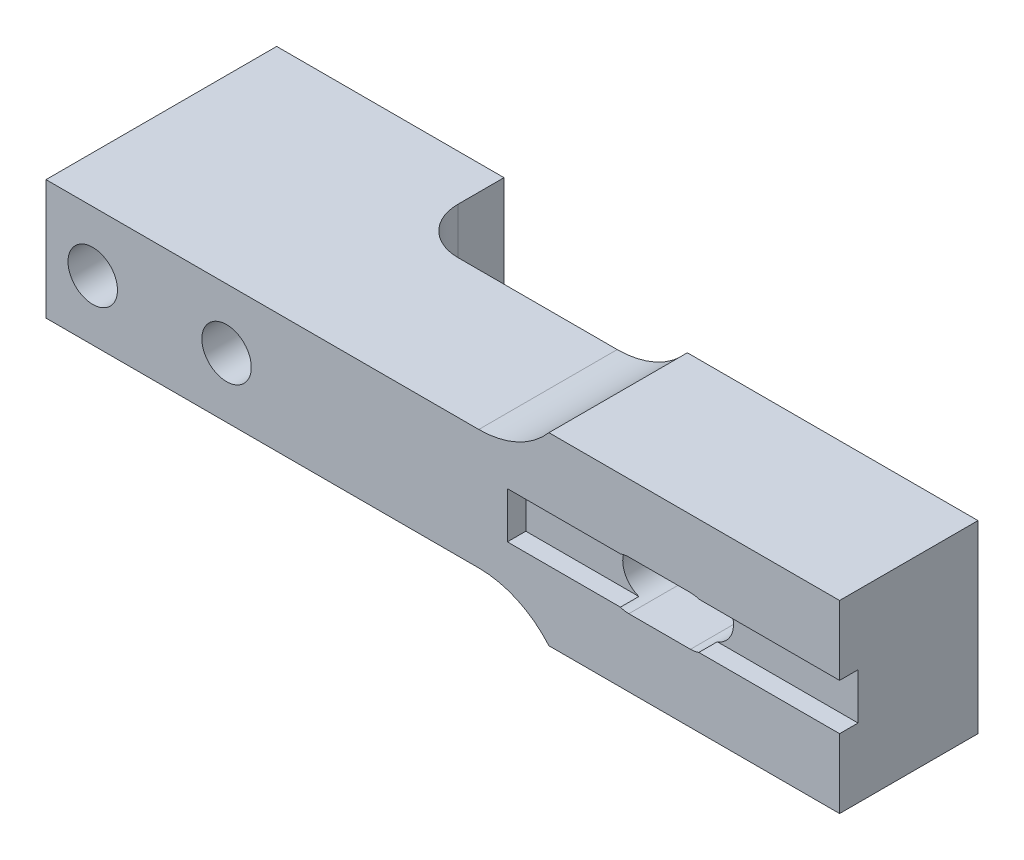
ISO-10303-21;
HEADER;
FILE_DESCRIPTION(('STEP AP214'),'2;1');
FILE_NAME('part.step','',(''),(''),'','','');
FILE_SCHEMA(('AUTOMOTIVE_DESIGN { 1 0 10303 214 1 1 1 1 }'));
ENDSEC;
DATA;
#1=APPLICATION_CONTEXT('core data for automotive mechanical design processes');
#2=APPLICATION_PROTOCOL_DEFINITION('international standard','automotive_design',2000,#1);
#3=PRODUCT_CONTEXT('',#1,'mechanical');
#4=PRODUCT('Part','Part','',(#3));
#5=PRODUCT_RELATED_PRODUCT_CATEGORY('part','',(#4));
#6=PRODUCT_DEFINITION_FORMATION('','',#4);
#7=PRODUCT_DEFINITION_CONTEXT('part definition',#1,'design');
#8=PRODUCT_DEFINITION('design','',#6,#7);
#9=PRODUCT_DEFINITION_SHAPE('','',#8);
#10=(LENGTH_UNIT() NAMED_UNIT(*) SI_UNIT(.MILLI.,.METRE.));
#11=(NAMED_UNIT(*) PLANE_ANGLE_UNIT() SI_UNIT($,.RADIAN.));
#12=(NAMED_UNIT(*) SI_UNIT($,.STERADIAN.) SOLID_ANGLE_UNIT());
#13=UNCERTAINTY_MEASURE_WITH_UNIT(LENGTH_MEASURE(1.E-05),#10,'distance_accuracy_value','');
#14=(GEOMETRIC_REPRESENTATION_CONTEXT(3) GLOBAL_UNCERTAINTY_ASSIGNED_CONTEXT((#13)) GLOBAL_UNIT_ASSIGNED_CONTEXT((#10,
#11,#12)) REPRESENTATION_CONTEXT('',''));
#15=CARTESIAN_POINT('',(0.,0.,0.));
#16=DIRECTION('',(0.,0.,1.));
#17=DIRECTION('',(1.,0.,0.));
#18=AXIS2_PLACEMENT_3D('',#15,#16,#17);
#19=CARTESIAN_POINT('',(0.,13.,10.));
#20=DIRECTION('',(0.,-1.,0.));
#21=DIRECTION('',(1.,0.,0.));
#22=AXIS2_PLACEMENT_3D('',#19,#20,#21);
#23=PLANE('',#22);
#24=DIRECTION('',(-1.,0.,0.));
#25=VECTOR('',#24,1.);
#26=CARTESIAN_POINT('',(0.,13.,25.));
#27=LINE('',#26,#25);
#28=CARTESIAN_POINT('',(46.9006579232147,13.,25.));
#29=VERTEX_POINT('',#28);
#30=CARTESIAN_POINT('',(0.,13.,25.));
#31=VERTEX_POINT('',#30);
#32=EDGE_CURVE('E357',#29,#31,#27,.T.);
#33=ORIENTED_EDGE('',*,*,#32,.F.);
#34=DIRECTION('',(0.,0.,-1.));
#35=VECTOR('',#34,1.);
#36=CARTESIAN_POINT('',(46.9006579232147,13.,10.));
#37=LINE('',#36,#35);
#38=CARTESIAN_POINT('',(46.9006579232147,13.,10.));
#39=VERTEX_POINT('',#38);
#40=EDGE_CURVE('E417',#29,#39,#37,.T.);
#41=ORIENTED_EDGE('',*,*,#40,.T.);
#42=DIRECTION('',(-1.,0.,0.));
#43=VECTOR('',#42,1.);
#44=CARTESIAN_POINT('',(0.,13.,10.));
#45=LINE('',#44,#43);
#46=CARTESIAN_POINT('',(29.634,13.,10.));
#47=VERTEX_POINT('',#46);
#48=EDGE_CURVE('E353',#39,#47,#45,.T.);
#49=ORIENTED_EDGE('',*,*,#48,.T.);
#50=CARTESIAN_POINT('',(29.634,13.,5.));
#51=DIRECTION('',(0.,-1.,0.));
#52=DIRECTION('',(1.,0.,0.));
#53=AXIS2_PLACEMENT_3D('',#50,#51,#52);
#54=CIRCLE('',#53,5.);
#55=CARTESIAN_POINT('',(24.634,13.,5.));
#56=VERTEX_POINT('',#55);
#57=EDGE_CURVE('E48',#47,#56,#54,.T.);
#58=ORIENTED_EDGE('',*,*,#57,.T.);
#59=DIRECTION('',(0.,0.,-1.));
#60=VECTOR('',#59,1.);
#61=CARTESIAN_POINT('',(24.634,13.,10.));
#62=LINE('',#61,#60);
#63=CARTESIAN_POINT('',(24.634,13.,0.));
#64=VERTEX_POINT('',#63);
#65=EDGE_CURVE('E383',#56,#64,#62,.T.);
#66=ORIENTED_EDGE('',*,*,#65,.T.);
#67=DIRECTION('',(-1.,0.,0.));
#68=VECTOR('',#67,1.);
#69=CARTESIAN_POINT('',(0.,13.,0.));
#70=LINE('',#69,#68);
#71=CARTESIAN_POINT('',(0.,13.,0.));
#72=VERTEX_POINT('',#71);
#73=EDGE_CURVE('E376',#64,#72,#70,.T.);
#74=ORIENTED_EDGE('',*,*,#73,.T.);
#75=DIRECTION('',(0.,0.,-1.));
#76=VECTOR('',#75,1.);
#77=CARTESIAN_POINT('',(0.,13.,10.));
#78=LINE('',#77,#76);
#79=EDGE_CURVE('E379',#31,#72,#78,.T.);
#80=ORIENTED_EDGE('',*,*,#79,.F.);
#81=EDGE_LOOP('',(#33,#41,#49,#58,#66,#74,#80));
#82=FACE_BOUND('',#81,.T.);
#83=ADVANCED_FACE('F39',(#82),#23,.F.);
#84=CARTESIAN_POINT('',(0.,13.,10.));
#85=DIRECTION('',(1.,0.,0.));
#86=DIRECTION('',(0.,0.,-1.));
#87=AXIS2_PLACEMENT_3D('',#84,#85,#86);
#88=PLANE('',#87);
#89=DIRECTION('',(0.,-1.,0.));
#90=VECTOR('',#89,1.);
#91=CARTESIAN_POINT('',(0.,13.,0.));
#92=LINE('',#91,#90);
#93=CARTESIAN_POINT('',(0.,0.,0.));
#94=VERTEX_POINT('',#93);
#95=EDGE_CURVE('E360',#72,#94,#92,.T.);
#96=ORIENTED_EDGE('',*,*,#95,.T.);
#97=DIRECTION('',(0.,0.,-1.));
#98=VECTOR('',#97,1.);
#99=CARTESIAN_POINT('',(0.,0.,10.));
#100=LINE('',#99,#98);
#101=CARTESIAN_POINT('',(0.,0.,25.));
#102=VERTEX_POINT('',#101);
#103=EDGE_CURVE('E389',#102,#94,#100,.T.);
#104=ORIENTED_EDGE('',*,*,#103,.F.);
#105=DIRECTION('',(0.,-1.,0.));
#106=VECTOR('',#105,1.);
#107=CARTESIAN_POINT('',(0.,0.,25.));
#108=LINE('',#107,#106);
#109=EDGE_CURVE('E348',#31,#102,#108,.T.);
#110=ORIENTED_EDGE('',*,*,#109,.F.);
#111=ORIENTED_EDGE('',*,*,#79,.T.);
#112=EDGE_LOOP('',(#96,#104,#110,#111));
#113=FACE_BOUND('',#112,.T.);
#114=ADVANCED_FACE('F481',(#113),#88,.F.);
#115=CARTESIAN_POINT('',(0.,0.,10.));
#116=DIRECTION('',(0.,1.,0.));
#117=DIRECTION('',(0.,0.,1.));
#118=AXIS2_PLACEMENT_3D('',#115,#116,#117);
#119=PLANE('',#118);
#120=DIRECTION('',(0.,0.,-1.));
#121=VECTOR('',#120,1.);
#122=CARTESIAN_POINT('',(24.634,0.,10.));
#123=LINE('',#122,#121);
#124=CARTESIAN_POINT('',(24.634,0.,5.));
#125=VERTEX_POINT('',#124);
#126=CARTESIAN_POINT('',(24.634,0.,0.));
#127=VERTEX_POINT('',#126);
#128=EDGE_CURVE('E386',#125,#127,#123,.T.);
#129=ORIENTED_EDGE('',*,*,#128,.F.);
#130=CARTESIAN_POINT('',(29.634,0.,5.));
#131=DIRECTION('',(0.,1.,0.));
#132=DIRECTION('',(0.,0.,1.));
#133=AXIS2_PLACEMENT_3D('',#130,#131,#132);
#134=CIRCLE('',#133,5.);
#135=CARTESIAN_POINT('',(29.634,0.,10.));
#136=VERTEX_POINT('',#135);
#137=EDGE_CURVE('E11',#125,#136,#134,.T.);
#138=ORIENTED_EDGE('',*,*,#137,.T.);
#139=DIRECTION('',(1.,0.,0.));
#140=VECTOR('',#139,1.);
#141=CARTESIAN_POINT('',(0.,0.,10.));
#142=LINE('',#141,#140);
#143=CARTESIAN_POINT('',(46.9006579232147,0.,10.));
#144=VERTEX_POINT('',#143);
#145=EDGE_CURVE('E347',#136,#144,#142,.T.);
#146=ORIENTED_EDGE('',*,*,#145,.T.);
#147=DIRECTION('',(0.,0.,1.));
#148=VECTOR('',#147,1.);
#149=CARTESIAN_POINT('',(46.9006579232147,0.,10.));
#150=LINE('',#149,#148);
#151=CARTESIAN_POINT('',(46.9006579232147,0.,25.));
#152=VERTEX_POINT('',#151);
#153=EDGE_CURVE('E420',#144,#152,#150,.T.);
#154=ORIENTED_EDGE('',*,*,#153,.T.);
#155=DIRECTION('',(1.,0.,0.));
#156=VECTOR('',#155,1.);
#157=CARTESIAN_POINT('',(0.,0.,25.));
#158=LINE('',#157,#156);
#159=EDGE_CURVE('E352',#102,#152,#158,.T.);
#160=ORIENTED_EDGE('',*,*,#159,.F.);
#161=ORIENTED_EDGE('',*,*,#103,.T.);
#162=DIRECTION('',(1.,0.,0.));
#163=VECTOR('',#162,1.);
#164=CARTESIAN_POINT('',(0.,0.,0.));
#165=LINE('',#164,#163);
#166=EDGE_CURVE('E368',#94,#127,#165,.T.);
#167=ORIENTED_EDGE('',*,*,#166,.T.);
#168=EDGE_LOOP('',(#129,#138,#146,#154,#160,#161,#167));
#169=FACE_BOUND('',#168,.T.);
#170=ADVANCED_FACE('F484',(#169),#119,.F.);
#171=CARTESIAN_POINT('',(24.634,13.,10.));
#172=DIRECTION('',(-1.,0.,0.));
#173=DIRECTION('',(0.,0.,1.));
#174=AXIS2_PLACEMENT_3D('',#171,#172,#173);
#175=PLANE('',#174);
#176=ORIENTED_EDGE('',*,*,#65,.F.);
#177=DIRECTION('',(0.,1.,0.));
#178=VECTOR('',#177,1.);
#179=CARTESIAN_POINT('',(24.634,13.,5.));
#180=LINE('',#179,#178);
#181=EDGE_CURVE('E55',#56,#125,#180,.F.);
#182=ORIENTED_EDGE('',*,*,#181,.T.);
#183=ORIENTED_EDGE('',*,*,#128,.T.);
#184=DIRECTION('',(0.,1.,0.));
#185=VECTOR('',#184,1.);
#186=CARTESIAN_POINT('',(24.634,13.,0.));
#187=LINE('',#186,#185);
#188=EDGE_CURVE('E372',#127,#64,#187,.T.);
#189=ORIENTED_EDGE('',*,*,#188,.T.);
#190=EDGE_LOOP('',(#176,#182,#183,#189));
#191=FACE_BOUND('',#190,.T.);
#192=ADVANCED_FACE('F506',(#191),#175,.F.);
#193=CARTESIAN_POINT('',(0.,0.,0.));
#194=DIRECTION('',(0.,0.,1.));
#195=DIRECTION('',(1.,0.,0.));
#196=AXIS2_PLACEMENT_3D('',#193,#194,#195);
#197=PLANE('',#196);
#198=CARTESIAN_POINT('',(5.067,6.5,0.));
#199=DIRECTION('',(0.,0.,-1.));
#200=DIRECTION('',(-1.,0.,0.));
#201=AXIS2_PLACEMENT_3D('',#198,#199,#200);
#202=CIRCLE('',#201,2.68);
#203=CARTESIAN_POINT('',(2.387,6.5,0.));
#204=VERTEX_POINT('',#203);
#205=EDGE_CURVE('E251',#204,#204,#202,.T.);
#206=ORIENTED_EDGE('',*,*,#205,.F.);
#207=EDGE_LOOP('',(#206));
#208=FACE_BOUND('',#207,.T.);
#209=CARTESIAN_POINT('',(19.567,6.5,0.));
#210=DIRECTION('',(0.,0.,-1.));
#211=DIRECTION('',(-1.,0.,0.));
#212=AXIS2_PLACEMENT_3D('',#209,#210,#211);
#213=CIRCLE('',#212,2.68);
#214=CARTESIAN_POINT('',(16.887,6.5,0.));
#215=VERTEX_POINT('',#214);
#216=EDGE_CURVE('E245',#215,#215,#213,.T.);
#217=ORIENTED_EDGE('',*,*,#216,.F.);
#218=EDGE_LOOP('',(#217));
#219=FACE_BOUND('',#218,.T.);
#220=ORIENTED_EDGE('',*,*,#95,.F.);
#221=ORIENTED_EDGE('',*,*,#73,.F.);
#222=ORIENTED_EDGE('',*,*,#188,.F.);
#223=ORIENTED_EDGE('',*,*,#166,.F.);
#224=EDGE_LOOP('',(#220,#221,#222,#223));
#225=FACE_BOUND('',#224,.T.);
#226=ADVANCED_FACE('F504',(#208,#219,#225),#197,.F.);
#227=CARTESIAN_POINT('',(0.,0.,25.));
#228=DIRECTION('',(0.,0.,-1.));
#229=DIRECTION('',(-1.,0.,0.));
#230=AXIS2_PLACEMENT_3D('',#227,#228,#229);
#231=PLANE('',#230);
#232=CARTESIAN_POINT('',(5.067,6.5,25.));
#233=DIRECTION('',(0.,0.,-1.));
#234=DIRECTION('',(-1.,0.,0.));
#235=AXIS2_PLACEMENT_3D('',#232,#233,#234);
#236=CIRCLE('',#235,2.68);
#237=CARTESIAN_POINT('',(2.387,6.5,25.));
#238=VERTEX_POINT('',#237);
#239=EDGE_CURVE('E246',#238,#238,#236,.T.);
#240=ORIENTED_EDGE('',*,*,#239,.T.);
#241=EDGE_LOOP('',(#240));
#242=FACE_BOUND('',#241,.T.);
#243=CARTESIAN_POINT('',(19.567,6.5,25.));
#244=DIRECTION('',(0.,0.,-1.));
#245=DIRECTION('',(-1.,0.,0.));
#246=AXIS2_PLACEMENT_3D('',#243,#244,#245);
#247=CIRCLE('',#246,2.68);
#248=CARTESIAN_POINT('',(16.887,6.5,25.));
#249=VERTEX_POINT('',#248);
#250=EDGE_CURVE('E255',#249,#249,#247,.T.);
#251=ORIENTED_EDGE('',*,*,#250,.T.);
#252=EDGE_LOOP('',(#251));
#253=FACE_BOUND('',#252,.T.);
#254=CARTESIAN_POINT('',(69.84,6.5,25.));
#255=DIRECTION('',(0.,0.,1.));
#256=DIRECTION('',(1.,0.,0.));
#257=AXIS2_PLACEMENT_3D('',#254,#255,#256);
#258=CIRCLE('',#257,2.66);
#259=CARTESIAN_POINT('',(70.7486253353281,9.,25.));
#260=VERTEX_POINT('',#259);
#261=CARTESIAN_POINT('',(69.84,9.16,25.));
#262=VERTEX_POINT('',#261);
#263=EDGE_CURVE('E311',#260,#262,#258,.T.);
#264=ORIENTED_EDGE('',*,*,#263,.F.);
#265=DIRECTION('',(-1.,0.,0.));
#266=VECTOR('',#265,1.);
#267=CARTESIAN_POINT('',(50.,9.,25.));
#268=LINE('',#267,#266);
#269=CARTESIAN_POINT('',(86.,9.00000000000001,25.));
#270=VERTEX_POINT('',#269);
#271=EDGE_CURVE('E211',#270,#260,#268,.T.);
#272=ORIENTED_EDGE('',*,*,#271,.F.);
#273=DIRECTION('',(0.,-1.,0.));
#274=VECTOR('',#273,1.);
#275=CARTESIAN_POINT('',(86.,16.5,25.));
#276=LINE('',#275,#274);
#277=CARTESIAN_POINT('',(86.,16.5,25.));
#278=VERTEX_POINT('',#277);
#279=EDGE_CURVE('E208',#278,#270,#276,.T.);
#280=ORIENTED_EDGE('',*,*,#279,.F.);
#281=DIRECTION('',(-1.,0.,0.));
#282=VECTOR('',#281,1.);
#283=CARTESIAN_POINT('',(54.5,16.5,25.));
#284=LINE('',#283,#282);
#285=CARTESIAN_POINT('',(54.5,16.5,25.));
#286=VERTEX_POINT('',#285);
#287=EDGE_CURVE('E194',#278,#286,#284,.T.);
#288=ORIENTED_EDGE('',*,*,#287,.T.);
#289=CARTESIAN_POINT('',(46.9006579232147,23.,25.));
#290=DIRECTION('',(0.,0.,-1.));
#291=DIRECTION('',(-1.,0.,0.));
#292=AXIS2_PLACEMENT_3D('',#289,#290,#291);
#293=CIRCLE('',#292,10.);
#294=EDGE_CURVE('E424',#286,#29,#293,.T.);
#295=ORIENTED_EDGE('',*,*,#294,.T.);
#296=ORIENTED_EDGE('',*,*,#32,.T.);
#297=ORIENTED_EDGE('',*,*,#109,.T.);
#298=ORIENTED_EDGE('',*,*,#159,.T.);
#299=CARTESIAN_POINT('',(46.9006579232147,-10.,25.));
#300=DIRECTION('',(0.,0.,-1.));
#301=DIRECTION('',(-1.,0.,0.));
#302=AXIS2_PLACEMENT_3D('',#299,#300,#301);
#303=CIRCLE('',#302,10.);
#304=CARTESIAN_POINT('',(54.5,-3.5,25.));
#305=VERTEX_POINT('',#304);
#306=EDGE_CURVE('E430',#152,#305,#303,.T.);
#307=ORIENTED_EDGE('',*,*,#306,.T.);
#308=DIRECTION('',(1.,0.,0.));
#309=VECTOR('',#308,1.);
#310=CARTESIAN_POINT('',(54.5,-3.5,25.));
#311=LINE('',#310,#309);
#312=CARTESIAN_POINT('',(86.,-3.5,25.));
#313=VERTEX_POINT('',#312);
#314=EDGE_CURVE('E337',#305,#313,#311,.T.);
#315=ORIENTED_EDGE('',*,*,#314,.T.);
#316=DIRECTION('',(0.,-1.,0.));
#317=VECTOR('',#316,1.);
#318=CARTESIAN_POINT('',(86.,4.,25.));
#319=LINE('',#318,#317);
#320=CARTESIAN_POINT('',(86.,4.,25.));
#321=VERTEX_POINT('',#320);
#322=EDGE_CURVE('E236',#321,#313,#319,.T.);
#323=ORIENTED_EDGE('',*,*,#322,.F.);
#324=DIRECTION('',(1.,0.,0.));
#325=VECTOR('',#324,1.);
#326=CARTESIAN_POINT('',(50.,4.,25.));
#327=LINE('',#326,#325);
#328=CARTESIAN_POINT('',(70.7486253353281,4.,25.));
#329=VERTEX_POINT('',#328);
#330=EDGE_CURVE('E278',#329,#321,#327,.T.);
#331=ORIENTED_EDGE('',*,*,#330,.F.);
#332=CARTESIAN_POINT('',(69.84,3.84,25.));
#333=VERTEX_POINT('',#332);
#334=EDGE_CURVE('E312',#333,#329,#258,.T.);
#335=ORIENTED_EDGE('',*,*,#334,.F.);
#336=DIRECTION('',(1.,0.,0.));
#337=VECTOR('',#336,1.);
#338=CARTESIAN_POINT('',(63.16,3.84,25.));
#339=LINE('',#338,#337);
#340=CARTESIAN_POINT('',(63.16,3.84,25.));
#341=VERTEX_POINT('',#340);
#342=EDGE_CURVE('E307',#341,#333,#339,.T.);
#343=ORIENTED_EDGE('',*,*,#342,.F.);
#344=CARTESIAN_POINT('',(63.16,6.5,25.));
#345=DIRECTION('',(0.,0.,1.));
#346=DIRECTION('',(1.,0.,0.));
#347=AXIS2_PLACEMENT_3D('',#344,#345,#346);
#348=CIRCLE('',#347,2.66);
#349=CARTESIAN_POINT('',(62.2513746646719,4.,25.));
#350=VERTEX_POINT('',#349);
#351=EDGE_CURVE('E302',#350,#341,#348,.T.);
#352=ORIENTED_EDGE('',*,*,#351,.F.);
#353=CARTESIAN_POINT('',(50.,4.,25.));
#354=VERTEX_POINT('',#353);
#355=EDGE_CURVE('E279',#354,#350,#327,.T.);
#356=ORIENTED_EDGE('',*,*,#355,.F.);
#357=DIRECTION('',(0.,-1.,0.));
#358=VECTOR('',#357,1.);
#359=CARTESIAN_POINT('',(50.,9.,25.));
#360=LINE('',#359,#358);
#361=CARTESIAN_POINT('',(50.,9.,25.));
#362=VERTEX_POINT('',#361);
#363=EDGE_CURVE('E250',#362,#354,#360,.T.);
#364=ORIENTED_EDGE('',*,*,#363,.F.);
#365=CARTESIAN_POINT('',(62.2513746646719,9.,25.));
#366=VERTEX_POINT('',#365);
#367=EDGE_CURVE('E282',#366,#362,#268,.T.);
#368=ORIENTED_EDGE('',*,*,#367,.F.);
#369=CARTESIAN_POINT('',(63.16,9.16,25.));
#370=VERTEX_POINT('',#369);
#371=EDGE_CURVE('E303',#370,#366,#348,.T.);
#372=ORIENTED_EDGE('',*,*,#371,.F.);
#373=DIRECTION('',(-1.,0.,0.));
#374=VECTOR('',#373,1.);
#375=CARTESIAN_POINT('',(63.16,9.16,25.));
#376=LINE('',#375,#374);
#377=EDGE_CURVE('E316',#262,#370,#376,.T.);
#378=ORIENTED_EDGE('',*,*,#377,.F.);
#379=EDGE_LOOP('',(#264,#272,#280,#288,#295,#296,#297,#298,#307,#315,#323,#331,#335,#343,#352,
#356,#364,#368,#372,#378));
#380=FACE_BOUND('',#379,.T.);
#381=ADVANCED_FACE('F210',(#242,#253,#380),#231,.F.);
#382=CARTESIAN_POINT('',(0.,0.,10.));
#383=DIRECTION('',(0.,0.,-1.));
#384=DIRECTION('',(-1.,0.,0.));
#385=AXIS2_PLACEMENT_3D('',#382,#383,#384);
#386=PLANE('',#385);
#387=CARTESIAN_POINT('',(63.16,6.5,10.));
#388=DIRECTION('',(0.,0.,-1.));
#389=DIRECTION('',(-1.,0.,0.));
#390=AXIS2_PLACEMENT_3D('',#387,#388,#389);
#391=CIRCLE('',#390,2.66);
#392=CARTESIAN_POINT('',(63.16,3.84,10.));
#393=VERTEX_POINT('',#392);
#394=CARTESIAN_POINT('',(63.16,9.16,10.));
#395=VERTEX_POINT('',#394);
#396=EDGE_CURVE('E403',#393,#395,#391,.T.);
#397=ORIENTED_EDGE('',*,*,#396,.F.);
#398=DIRECTION('',(-1.,0.,0.));
#399=VECTOR('',#398,1.);
#400=CARTESIAN_POINT('',(0.,3.84000000000002,10.));
#401=LINE('',#400,#399);
#402=CARTESIAN_POINT('',(69.84,3.84,10.));
#403=VERTEX_POINT('',#402);
#404=EDGE_CURVE('E393',#403,#393,#401,.T.);
#405=ORIENTED_EDGE('',*,*,#404,.F.);
#406=CARTESIAN_POINT('',(69.84,6.5,10.));
#407=DIRECTION('',(0.,0.,-1.));
#408=DIRECTION('',(-1.,0.,0.));
#409=AXIS2_PLACEMENT_3D('',#406,#407,#408);
#410=CIRCLE('',#409,2.66);
#411=CARTESIAN_POINT('',(69.84,9.16,10.));
#412=VERTEX_POINT('',#411);
#413=EDGE_CURVE('E396',#412,#403,#410,.T.);
#414=ORIENTED_EDGE('',*,*,#413,.F.);
#415=DIRECTION('',(1.,0.,0.));
#416=VECTOR('',#415,1.);
#417=CARTESIAN_POINT('',(0.,9.15999999999999,10.));
#418=LINE('',#417,#416);
#419=EDGE_CURVE('E400',#395,#412,#418,.T.);
#420=ORIENTED_EDGE('',*,*,#419,.F.);
#421=EDGE_LOOP('',(#397,#405,#414,#420));
#422=FACE_BOUND('',#421,.T.);
#423=ORIENTED_EDGE('',*,*,#145,.F.);
#424=DIRECTION('',(0.,1.,0.));
#425=VECTOR('',#424,1.);
#426=CARTESIAN_POINT('',(29.634,0.,10.));
#427=LINE('',#426,#425);
#428=EDGE_CURVE('E437',#136,#47,#427,.T.);
#429=ORIENTED_EDGE('',*,*,#428,.T.);
#430=ORIENTED_EDGE('',*,*,#48,.F.);
#431=CARTESIAN_POINT('',(46.9006579232147,23.,10.));
#432=DIRECTION('',(0.,0.,-1.));
#433=DIRECTION('',(-1.,0.,0.));
#434=AXIS2_PLACEMENT_3D('',#431,#432,#433);
#435=CIRCLE('',#434,10.);
#436=CARTESIAN_POINT('',(54.5,16.5,10.));
#437=VERTEX_POINT('',#436);
#438=EDGE_CURVE('E427',#39,#437,#435,.F.);
#439=ORIENTED_EDGE('',*,*,#438,.T.);
#440=DIRECTION('',(-1.,0.,0.));
#441=VECTOR('',#440,1.);
#442=CARTESIAN_POINT('',(54.5,16.5,10.));
#443=LINE('',#442,#441);
#444=CARTESIAN_POINT('',(86.,16.5,10.));
#445=VERTEX_POINT('',#444);
#446=EDGE_CURVE('E204',#445,#437,#443,.T.);
#447=ORIENTED_EDGE('',*,*,#446,.F.);
#448=DIRECTION('',(0.,1.,0.));
#449=VECTOR('',#448,1.);
#450=CARTESIAN_POINT('',(86.,-3.5,10.));
#451=LINE('',#450,#449);
#452=CARTESIAN_POINT('',(86.,-3.5,10.));
#453=VERTEX_POINT('',#452);
#454=EDGE_CURVE('E222',#453,#445,#451,.T.);
#455=ORIENTED_EDGE('',*,*,#454,.F.);
#456=DIRECTION('',(1.,0.,0.));
#457=VECTOR('',#456,1.);
#458=CARTESIAN_POINT('',(54.5,-3.5,10.));
#459=LINE('',#458,#457);
#460=CARTESIAN_POINT('',(54.5,-3.5,10.));
#461=VERTEX_POINT('',#460);
#462=EDGE_CURVE('E340',#461,#453,#459,.T.);
#463=ORIENTED_EDGE('',*,*,#462,.F.);
#464=CARTESIAN_POINT('',(46.9006579232147,-10.,10.));
#465=DIRECTION('',(0.,0.,-1.));
#466=DIRECTION('',(-1.,0.,0.));
#467=AXIS2_PLACEMENT_3D('',#464,#465,#466);
#468=CIRCLE('',#467,10.);
#469=EDGE_CURVE('E433',#461,#144,#468,.F.);
#470=ORIENTED_EDGE('',*,*,#469,.T.);
#471=EDGE_LOOP('',(#423,#429,#430,#439,#447,#455,#463,#470));
#472=FACE_BOUND('',#471,.T.);
#473=ADVANCED_FACE('F468',(#422,#472),#386,.T.);
#474=CARTESIAN_POINT('',(54.5,-3.5,-18.2179021190449));
#475=DIRECTION('',(0.,-1.,0.));
#476=DIRECTION('',(0.,0.,-1.));
#477=AXIS2_PLACEMENT_3D('',#474,#475,#476);
#478=PLANE('',#477);
#479=DIRECTION('',(0.,0.,1.));
#480=VECTOR('',#479,1.);
#481=CARTESIAN_POINT('',(54.5,-3.5,-18.2179021190449));
#482=LINE('',#481,#480);
#483=EDGE_CURVE('E343',#461,#305,#482,.T.);
#484=ORIENTED_EDGE('',*,*,#483,.F.);
#485=ORIENTED_EDGE('',*,*,#462,.T.);
#486=DIRECTION('',(0.,0.,-1.));
#487=VECTOR('',#486,1.);
#488=CARTESIAN_POINT('',(86.,-3.5,25.));
#489=LINE('',#488,#487);
#490=EDGE_CURVE('E240',#313,#453,#489,.T.);
#491=ORIENTED_EDGE('',*,*,#490,.F.);
#492=ORIENTED_EDGE('',*,*,#314,.F.);
#493=EDGE_LOOP('',(#484,#485,#491,#492));
#494=FACE_BOUND('',#493,.T.);
#495=ADVANCED_FACE('F461',(#494),#478,.T.);
#496=CARTESIAN_POINT('',(54.5,16.5,-18.2179021190449));
#497=DIRECTION('',(0.,1.,0.));
#498=DIRECTION('',(0.,0.,1.));
#499=AXIS2_PLACEMENT_3D('',#496,#497,#498);
#500=PLANE('',#499);
#501=ORIENTED_EDGE('',*,*,#287,.F.);
#502=DIRECTION('',(0.,0.,1.));
#503=VECTOR('',#502,1.);
#504=CARTESIAN_POINT('',(86.,16.5,10.));
#505=LINE('',#504,#503);
#506=EDGE_CURVE('E199',#445,#278,#505,.T.);
#507=ORIENTED_EDGE('',*,*,#506,.F.);
#508=ORIENTED_EDGE('',*,*,#446,.T.);
#509=DIRECTION('',(0.,0.,1.));
#510=VECTOR('',#509,1.);
#511=CARTESIAN_POINT('',(54.5,16.5,-18.2179021190449));
#512=LINE('',#511,#510);
#513=EDGE_CURVE('E201',#437,#286,#512,.T.);
#514=ORIENTED_EDGE('',*,*,#513,.T.);
#515=EDGE_LOOP('',(#501,#507,#508,#514));
#516=FACE_BOUND('',#515,.T.);
#517=ADVANCED_FACE('F196',(#516),#500,.T.);
#518=CARTESIAN_POINT('',(63.16,6.5,0.));
#519=DIRECTION('',(0.,0.,1.));
#520=DIRECTION('',(1.,0.,0.));
#521=AXIS2_PLACEMENT_3D('',#518,#519,#520);
#522=CYLINDRICAL_SURFACE('',#521,2.66);
#523=ORIENTED_EDGE('',*,*,#371,.T.);
#524=DIRECTION('',(0.,0.,1.));
#525=VECTOR('',#524,1.);
#526=CARTESIAN_POINT('',(62.2513746646719,9.,0.));
#527=LINE('',#526,#525);
#528=CARTESIAN_POINT('',(62.2513746646719,9.,23.));
#529=VERTEX_POINT('',#528);
#530=EDGE_CURVE('E298',#366,#529,#527,.F.);
#531=ORIENTED_EDGE('',*,*,#530,.T.);
#532=CARTESIAN_POINT('',(63.16,6.5,23.));
#533=DIRECTION('',(0.,0.,1.));
#534=DIRECTION('',(1.,0.,0.));
#535=AXIS2_PLACEMENT_3D('',#532,#533,#534);
#536=CIRCLE('',#535,2.66);
#537=CARTESIAN_POINT('',(62.2513746646719,4.,23.));
#538=VERTEX_POINT('',#537);
#539=EDGE_CURVE('E289',#538,#529,#536,.F.);
#540=ORIENTED_EDGE('',*,*,#539,.F.);
#541=DIRECTION('',(0.,0.,1.));
#542=VECTOR('',#541,1.);
#543=CARTESIAN_POINT('',(62.2513746646719,4.,0.));
#544=LINE('',#543,#542);
#545=EDGE_CURVE('E294',#538,#350,#544,.T.);
#546=ORIENTED_EDGE('',*,*,#545,.T.);
#547=ORIENTED_EDGE('',*,*,#351,.T.);
#548=DIRECTION('',(0.,0.,1.));
#549=VECTOR('',#548,1.);
#550=CARTESIAN_POINT('',(63.16,3.84,0.));
#551=LINE('',#550,#549);
#552=EDGE_CURVE('E320',#393,#341,#551,.T.);
#553=ORIENTED_EDGE('',*,*,#552,.F.);
#554=ORIENTED_EDGE('',*,*,#396,.T.);
#555=DIRECTION('',(0.,0.,1.));
#556=VECTOR('',#555,1.);
#557=CARTESIAN_POINT('',(63.16,9.16,0.));
#558=LINE('',#557,#556);
#559=EDGE_CURVE('E205',#395,#370,#558,.T.);
#560=ORIENTED_EDGE('',*,*,#559,.T.);
#561=EDGE_LOOP('',(#523,#531,#540,#546,#547,#553,#554,#560));
#562=FACE_BOUND('',#561,.T.);
#563=ADVANCED_FACE('F548',(#562),#522,.F.);
#564=CARTESIAN_POINT('',(63.16,9.16,0.));
#565=DIRECTION('',(0.,1.,0.));
#566=DIRECTION('',(-1.,0.,0.));
#567=AXIS2_PLACEMENT_3D('',#564,#565,#566);
#568=PLANE('',#567);
#569=ORIENTED_EDGE('',*,*,#419,.T.);
#570=DIRECTION('',(0.,0.,1.));
#571=VECTOR('',#570,1.);
#572=CARTESIAN_POINT('',(69.84,9.16,0.));
#573=LINE('',#572,#571);
#574=EDGE_CURVE('E323',#412,#262,#573,.T.);
#575=ORIENTED_EDGE('',*,*,#574,.T.);
#576=ORIENTED_EDGE('',*,*,#377,.T.);
#577=ORIENTED_EDGE('',*,*,#559,.F.);
#578=EDGE_LOOP('',(#569,#575,#576,#577));
#579=FACE_BOUND('',#578,.T.);
#580=ADVANCED_FACE('F544',(#579),#568,.F.);
#581=CARTESIAN_POINT('',(69.84,6.5,0.));
#582=DIRECTION('',(0.,0.,1.));
#583=DIRECTION('',(1.,0.,0.));
#584=AXIS2_PLACEMENT_3D('',#581,#582,#583);
#585=CYLINDRICAL_SURFACE('',#584,2.66);
#586=CARTESIAN_POINT('',(69.84,6.5,23.));
#587=DIRECTION('',(0.,0.,1.));
#588=DIRECTION('',(1.,0.,0.));
#589=AXIS2_PLACEMENT_3D('',#586,#587,#588);
#590=CIRCLE('',#589,2.66);
#591=CARTESIAN_POINT('',(70.7486253353281,9.,23.));
#592=VERTEX_POINT('',#591);
#593=CARTESIAN_POINT('',(70.7486253353281,4.,23.));
#594=VERTEX_POINT('',#593);
#595=EDGE_CURVE('E406',#592,#594,#590,.F.);
#596=ORIENTED_EDGE('',*,*,#595,.F.);
#597=DIRECTION('',(0.,0.,1.));
#598=VECTOR('',#597,1.);
#599=CARTESIAN_POINT('',(70.7486253353281,9.,0.));
#600=LINE('',#599,#598);
#601=EDGE_CURVE('E413',#592,#260,#600,.T.);
#602=ORIENTED_EDGE('',*,*,#601,.T.);
#603=ORIENTED_EDGE('',*,*,#263,.T.);
#604=ORIENTED_EDGE('',*,*,#574,.F.);
#605=ORIENTED_EDGE('',*,*,#413,.T.);
#606=DIRECTION('',(0.,0.,1.));
#607=VECTOR('',#606,1.);
#608=CARTESIAN_POINT('',(69.84,3.84,0.));
#609=LINE('',#608,#607);
#610=EDGE_CURVE('E327',#403,#333,#609,.T.);
#611=ORIENTED_EDGE('',*,*,#610,.T.);
#612=ORIENTED_EDGE('',*,*,#334,.T.);
#613=DIRECTION('',(0.,0.,1.));
#614=VECTOR('',#613,1.);
#615=CARTESIAN_POINT('',(70.7486253353281,4.,0.));
#616=LINE('',#615,#614);
#617=EDGE_CURVE('E409',#329,#594,#616,.F.);
#618=ORIENTED_EDGE('',*,*,#617,.T.);
#619=EDGE_LOOP('',(#596,#602,#603,#604,#605,#611,#612,#618));
#620=FACE_BOUND('',#619,.T.);
#621=ADVANCED_FACE('F547',(#620),#585,.F.);
#622=CARTESIAN_POINT('',(63.16,3.84,0.));
#623=DIRECTION('',(0.,-1.,0.));
#624=DIRECTION('',(1.,0.,0.));
#625=AXIS2_PLACEMENT_3D('',#622,#623,#624);
#626=PLANE('',#625);
#627=ORIENTED_EDGE('',*,*,#404,.T.);
#628=ORIENTED_EDGE('',*,*,#552,.T.);
#629=ORIENTED_EDGE('',*,*,#342,.T.);
#630=ORIENTED_EDGE('',*,*,#610,.F.);
#631=EDGE_LOOP('',(#627,#628,#629,#630));
#632=FACE_BOUND('',#631,.T.);
#633=ADVANCED_FACE('F552',(#632),#626,.F.);
#634=CARTESIAN_POINT('',(0.,0.,23.));
#635=DIRECTION('',(0.,0.,1.));
#636=DIRECTION('',(1.,0.,0.));
#637=AXIS2_PLACEMENT_3D('',#634,#635,#636);
#638=PLANE('',#637);
#639=ORIENTED_EDGE('',*,*,#595,.T.);
#640=DIRECTION('',(1.,0.,0.));
#641=VECTOR('',#640,1.);
#642=CARTESIAN_POINT('',(50.,4.,23.));
#643=LINE('',#642,#641);
#644=CARTESIAN_POINT('',(86.,4.,23.));
#645=VERTEX_POINT('',#644);
#646=EDGE_CURVE('E266',#594,#645,#643,.T.);
#647=ORIENTED_EDGE('',*,*,#646,.T.);
#648=DIRECTION('',(0.,-1.,0.));
#649=VECTOR('',#648,1.);
#650=CARTESIAN_POINT('',(86.,9.00000000000001,23.));
#651=LINE('',#650,#649);
#652=CARTESIAN_POINT('',(86.,9.00000000000001,23.));
#653=VERTEX_POINT('',#652);
#654=EDGE_CURVE('E228',#653,#645,#651,.T.);
#655=ORIENTED_EDGE('',*,*,#654,.F.);
#656=DIRECTION('',(-1.,0.,0.));
#657=VECTOR('',#656,1.);
#658=CARTESIAN_POINT('',(50.,9.,23.));
#659=LINE('',#658,#657);
#660=EDGE_CURVE('E271',#653,#592,#659,.T.);
#661=ORIENTED_EDGE('',*,*,#660,.T.);
#662=EDGE_LOOP('',(#639,#647,#655,#661));
#663=FACE_BOUND('',#662,.T.);
#664=ADVANCED_FACE('F532',(#663),#638,.T.);
#665=CARTESIAN_POINT('',(50.,4.,23.));
#666=DIRECTION('',(0.,-1.,0.));
#667=DIRECTION('',(1.,0.,0.));
#668=AXIS2_PLACEMENT_3D('',#665,#666,#667);
#669=PLANE('',#668);
#670=ORIENTED_EDGE('',*,*,#330,.T.);
#671=DIRECTION('',(0.,0.,1.));
#672=VECTOR('',#671,1.);
#673=CARTESIAN_POINT('',(86.,4.,23.));
#674=LINE('',#673,#672);
#675=EDGE_CURVE('E232',#645,#321,#674,.T.);
#676=ORIENTED_EDGE('',*,*,#675,.F.);
#677=ORIENTED_EDGE('',*,*,#646,.F.);
#678=ORIENTED_EDGE('',*,*,#617,.F.);
#679=EDGE_LOOP('',(#670,#676,#677,#678));
#680=FACE_BOUND('',#679,.T.);
#681=ADVANCED_FACE('F452',(#680),#669,.F.);
#682=CARTESIAN_POINT('',(50.,9.,23.));
#683=DIRECTION('',(0.,1.,0.));
#684=DIRECTION('',(-1.,0.,0.));
#685=AXIS2_PLACEMENT_3D('',#682,#683,#684);
#686=PLANE('',#685);
#687=ORIENTED_EDGE('',*,*,#660,.F.);
#688=DIRECTION('',(0.,0.,-1.));
#689=VECTOR('',#688,1.);
#690=CARTESIAN_POINT('',(86.,9.00000000000001,25.));
#691=LINE('',#690,#689);
#692=EDGE_CURVE('E216',#270,#653,#691,.T.);
#693=ORIENTED_EDGE('',*,*,#692,.F.);
#694=ORIENTED_EDGE('',*,*,#271,.T.);
#695=ORIENTED_EDGE('',*,*,#601,.F.);
#696=EDGE_LOOP('',(#687,#693,#694,#695));
#697=FACE_BOUND('',#696,.T.);
#698=ADVANCED_FACE('F536',(#697),#686,.F.);
#699=ORIENTED_EDGE('',*,*,#367,.T.);
#700=DIRECTION('',(0.,0.,1.));
#701=VECTOR('',#700,1.);
#702=CARTESIAN_POINT('',(50.,9.,23.));
#703=LINE('',#702,#701);
#704=CARTESIAN_POINT('',(50.,9.,23.));
#705=VERTEX_POINT('',#704);
#706=EDGE_CURVE('E285',#705,#362,#703,.T.);
#707=ORIENTED_EDGE('',*,*,#706,.F.);
#708=EDGE_CURVE('E270',#529,#705,#659,.T.);
#709=ORIENTED_EDGE('',*,*,#708,.F.);
#710=ORIENTED_EDGE('',*,*,#530,.F.);
#711=EDGE_LOOP('',(#699,#707,#709,#710));
#712=FACE_BOUND('',#711,.T.);
#713=ADVANCED_FACE('F533',(#712),#686,.F.);
#714=CARTESIAN_POINT('',(50.,4.,23.));
#715=VERTEX_POINT('',#714);
#716=EDGE_CURVE('E267',#715,#538,#643,.T.);
#717=ORIENTED_EDGE('',*,*,#716,.F.);
#718=DIRECTION('',(0.,0.,1.));
#719=VECTOR('',#718,1.);
#720=CARTESIAN_POINT('',(50.,4.,23.));
#721=LINE('',#720,#719);
#722=EDGE_CURVE('E274',#715,#354,#721,.T.);
#723=ORIENTED_EDGE('',*,*,#722,.T.);
#724=ORIENTED_EDGE('',*,*,#355,.T.);
#725=ORIENTED_EDGE('',*,*,#545,.F.);
#726=EDGE_LOOP('',(#717,#723,#724,#725));
#727=FACE_BOUND('',#726,.T.);
#728=ADVANCED_FACE('F530',(#727),#669,.F.);
#729=ORIENTED_EDGE('',*,*,#539,.T.);
#730=ORIENTED_EDGE('',*,*,#708,.T.);
#731=DIRECTION('',(0.,-1.,0.));
#732=VECTOR('',#731,1.);
#733=CARTESIAN_POINT('',(50.,9.,23.));
#734=LINE('',#733,#732);
#735=EDGE_CURVE('E262',#705,#715,#734,.T.);
#736=ORIENTED_EDGE('',*,*,#735,.T.);
#737=ORIENTED_EDGE('',*,*,#716,.T.);
#738=EDGE_LOOP('',(#729,#730,#736,#737));
#739=FACE_BOUND('',#738,.T.);
#740=ADVANCED_FACE('F527',(#739),#638,.T.);
#741=CARTESIAN_POINT('',(50.,9.,23.));
#742=DIRECTION('',(-1.,0.,0.));
#743=DIRECTION('',(0.,-1.,0.));
#744=AXIS2_PLACEMENT_3D('',#741,#742,#743);
#745=PLANE('',#744);
#746=ORIENTED_EDGE('',*,*,#363,.T.);
#747=ORIENTED_EDGE('',*,*,#722,.F.);
#748=ORIENTED_EDGE('',*,*,#735,.F.);
#749=ORIENTED_EDGE('',*,*,#706,.T.);
#750=EDGE_LOOP('',(#746,#747,#748,#749));
#751=FACE_BOUND('',#750,.T.);
#752=ADVANCED_FACE('F521',(#751),#745,.F.);
#753=CARTESIAN_POINT('',(19.567,6.5,25.));
#754=DIRECTION('',(0.,0.,-1.));
#755=DIRECTION('',(-1.,0.,0.));
#756=AXIS2_PLACEMENT_3D('',#753,#754,#755);
#757=CYLINDRICAL_SURFACE('',#756,2.68);
#758=ORIENTED_EDGE('',*,*,#250,.F.);
#759=EDGE_LOOP('',(#758));
#760=FACE_BOUND('',#759,.T.);
#761=ORIENTED_EDGE('',*,*,#216,.T.);
#762=EDGE_LOOP('',(#761));
#763=FACE_BOUND('',#762,.T.);
#764=ADVANCED_FACE('F515',(#760,#763),#757,.F.);
#765=CARTESIAN_POINT('',(5.067,6.5,25.));
#766=DIRECTION('',(0.,0.,-1.));
#767=DIRECTION('',(-1.,0.,0.));
#768=AXIS2_PLACEMENT_3D('',#765,#766,#767);
#769=CYLINDRICAL_SURFACE('',#768,2.68);
#770=ORIENTED_EDGE('',*,*,#239,.F.);
#771=EDGE_LOOP('',(#770));
#772=FACE_BOUND('',#771,.T.);
#773=ORIENTED_EDGE('',*,*,#205,.T.);
#774=EDGE_LOOP('',(#773));
#775=FACE_BOUND('',#774,.T.);
#776=ADVANCED_FACE('F511',(#772,#775),#769,.F.);
#777=CARTESIAN_POINT('',(46.9006579232147,23.,-18.2179021190449));
#778=DIRECTION('',(0.,0.,-1.));
#779=DIRECTION('',(-1.,0.,0.));
#780=AXIS2_PLACEMENT_3D('',#777,#778,#779);
#781=CYLINDRICAL_SURFACE('',#780,10.);
#782=ORIENTED_EDGE('',*,*,#438,.F.);
#783=ORIENTED_EDGE('',*,*,#40,.F.);
#784=ORIENTED_EDGE('',*,*,#294,.F.);
#785=ORIENTED_EDGE('',*,*,#513,.F.);
#786=EDGE_LOOP('',(#782,#783,#784,#785));
#787=FACE_BOUND('',#786,.T.);
#788=ADVANCED_FACE('F473',(#787),#781,.F.);
#789=CARTESIAN_POINT('',(46.9006579232147,-10.,-18.2179021190449));
#790=DIRECTION('',(0.,0.,1.));
#791=DIRECTION('',(1.,0.,0.));
#792=AXIS2_PLACEMENT_3D('',#789,#790,#791);
#793=CYLINDRICAL_SURFACE('',#792,10.);
#794=ORIENTED_EDGE('',*,*,#469,.F.);
#795=ORIENTED_EDGE('',*,*,#483,.T.);
#796=ORIENTED_EDGE('',*,*,#306,.F.);
#797=ORIENTED_EDGE('',*,*,#153,.F.);
#798=EDGE_LOOP('',(#794,#795,#796,#797));
#799=FACE_BOUND('',#798,.T.);
#800=ADVANCED_FACE('F464',(#799),#793,.F.);
#801=CARTESIAN_POINT('',(29.634,0.,5.));
#802=DIRECTION('',(0.,1.,0.));
#803=DIRECTION('',(0.,0.,1.));
#804=AXIS2_PLACEMENT_3D('',#801,#802,#803);
#805=CYLINDRICAL_SURFACE('',#804,5.);
#806=ORIENTED_EDGE('',*,*,#137,.F.);
#807=ORIENTED_EDGE('',*,*,#181,.F.);
#808=ORIENTED_EDGE('',*,*,#57,.F.);
#809=ORIENTED_EDGE('',*,*,#428,.F.);
#810=EDGE_LOOP('',(#806,#807,#808,#809));
#811=FACE_BOUND('',#810,.T.);
#812=ADVANCED_FACE('F41',(#811),#805,.F.);
#813=CARTESIAN_POINT('',(86.,0.,0.));
#814=DIRECTION('',(1.,0.,0.));
#815=DIRECTION('',(0.,0.,-1.));
#816=AXIS2_PLACEMENT_3D('',#813,#814,#815);
#817=PLANE('',#816);
#818=ORIENTED_EDGE('',*,*,#506,.T.);
#819=ORIENTED_EDGE('',*,*,#279,.T.);
#820=ORIENTED_EDGE('',*,*,#692,.T.);
#821=ORIENTED_EDGE('',*,*,#654,.T.);
#822=ORIENTED_EDGE('',*,*,#675,.T.);
#823=ORIENTED_EDGE('',*,*,#322,.T.);
#824=ORIENTED_EDGE('',*,*,#490,.T.);
#825=ORIENTED_EDGE('',*,*,#454,.T.);
#826=EDGE_LOOP('',(#818,#819,#820,#821,#822,#823,#824,#825));
#827=FACE_BOUND('',#826,.T.);
#828=ADVANCED_FACE('F219',(#827),#817,.T.);
#829=CLOSED_SHELL('',(#83,#114,#170,#192,#226,#381,#473,#495,#517,#563,#580,#621,#633,#664,#681,
#698,#713,#728,#740,#752,#764,#776,#788,#800,#812,#828));
#830=MANIFOLD_SOLID_BREP('B2',#829);
#831=ADVANCED_BREP_SHAPE_REPRESENTATION('',(#18,#830),#14);
#832=SHAPE_DEFINITION_REPRESENTATION(#9,#831);
ENDSEC;
END-ISO-10303-21;
